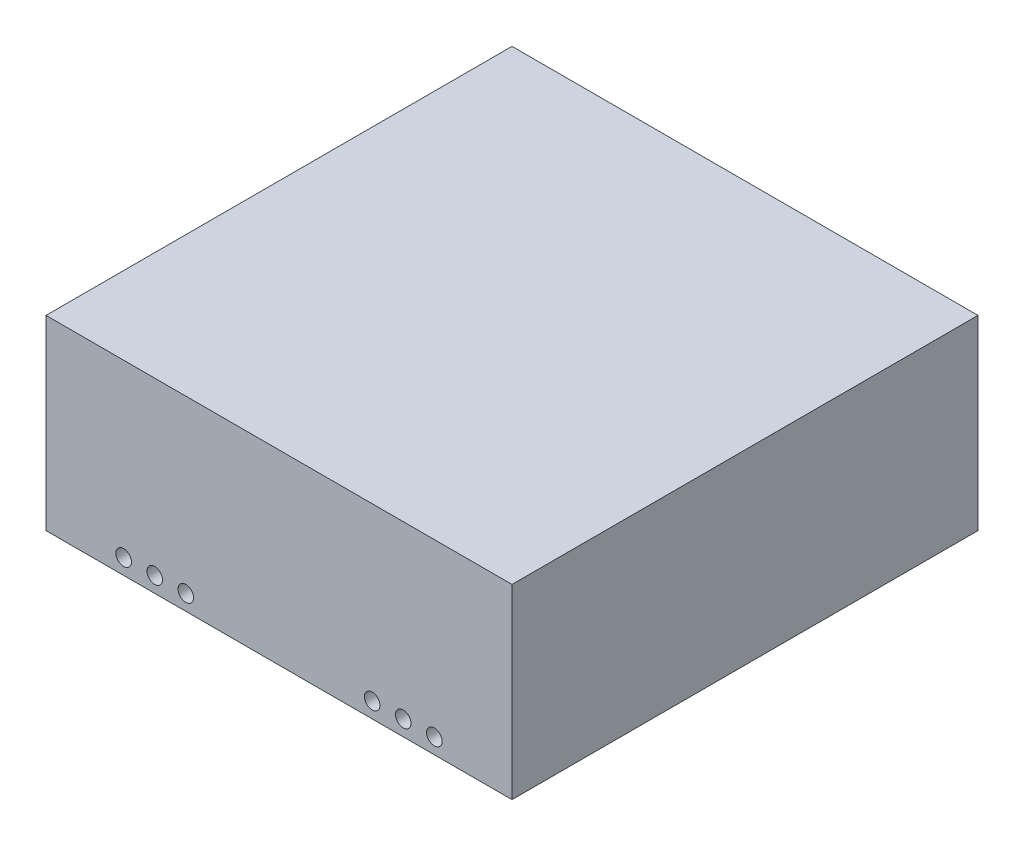
ISO-10303-21;
HEADER;
FILE_DESCRIPTION(('STEP AP214'),'2;1');
FILE_NAME('part.step','',(''),(''),'','','');
FILE_SCHEMA(('AUTOMOTIVE_DESIGN { 1 0 10303 214 1 1 1 1 }'));
ENDSEC;
DATA;
#1=APPLICATION_CONTEXT('core data for automotive mechanical design processes');
#2=APPLICATION_PROTOCOL_DEFINITION('international standard','automotive_design',2000,#1);
#3=PRODUCT_CONTEXT('',#1,'mechanical');
#4=PRODUCT('Part','Part','',(#3));
#5=PRODUCT_RELATED_PRODUCT_CATEGORY('part','',(#4));
#6=PRODUCT_DEFINITION_FORMATION('','',#4);
#7=PRODUCT_DEFINITION_CONTEXT('part definition',#1,'design');
#8=PRODUCT_DEFINITION('design','',#6,#7);
#9=PRODUCT_DEFINITION_SHAPE('','',#8);
#10=(LENGTH_UNIT() NAMED_UNIT(*) SI_UNIT(.MILLI.,.METRE.));
#11=(NAMED_UNIT(*) PLANE_ANGLE_UNIT() SI_UNIT($,.RADIAN.));
#12=(NAMED_UNIT(*) SI_UNIT($,.STERADIAN.) SOLID_ANGLE_UNIT());
#13=UNCERTAINTY_MEASURE_WITH_UNIT(LENGTH_MEASURE(1.E-05),#10,'distance_accuracy_value','');
#14=(GEOMETRIC_REPRESENTATION_CONTEXT(3) GLOBAL_UNCERTAINTY_ASSIGNED_CONTEXT((#13)) GLOBAL_UNIT_ASSIGNED_CONTEXT((#10,
#11,#12)) REPRESENTATION_CONTEXT('',''));
#15=CARTESIAN_POINT('',(0.,0.,0.));
#16=DIRECTION('',(0.,0.,1.));
#17=DIRECTION('',(1.,0.,0.));
#18=AXIS2_PLACEMENT_3D('',#15,#16,#17);
#19=CARTESIAN_POINT('',(75.,60.,-75.));
#20=DIRECTION('',(-1.,0.,0.));
#21=DIRECTION('',(0.,0.,1.));
#22=AXIS2_PLACEMENT_3D('',#19,#20,#21);
#23=PLANE('',#22);
#24=DIRECTION('',(0.,0.,-1.));
#25=VECTOR('',#24,1.);
#26=CARTESIAN_POINT('',(75.,0.,-75.));
#27=LINE('',#26,#25);
#28=CARTESIAN_POINT('',(75.,0.,75.));
#29=VERTEX_POINT('',#28);
#30=CARTESIAN_POINT('',(75.,0.,-75.));
#31=VERTEX_POINT('',#30);
#32=EDGE_CURVE('E135',#29,#31,#27,.T.);
#33=ORIENTED_EDGE('',*,*,#32,.T.);
#34=DIRECTION('',(0.,-1.,0.));
#35=VECTOR('',#34,1.);
#36=CARTESIAN_POINT('',(75.,60.,-75.));
#37=LINE('',#36,#35);
#38=CARTESIAN_POINT('',(75.,60.,-75.));
#39=VERTEX_POINT('',#38);
#40=EDGE_CURVE('E11',#39,#31,#37,.T.);
#41=ORIENTED_EDGE('',*,*,#40,.F.);
#42=DIRECTION('',(0.,0.,-1.));
#43=VECTOR('',#42,1.);
#44=CARTESIAN_POINT('',(75.,60.,-75.));
#45=LINE('',#44,#43);
#46=CARTESIAN_POINT('',(75.,60.,75.));
#47=VERTEX_POINT('',#46);
#48=EDGE_CURVE('E159',#47,#39,#45,.T.);
#49=ORIENTED_EDGE('',*,*,#48,.F.);
#50=DIRECTION('',(0.,-1.,0.));
#51=VECTOR('',#50,1.);
#52=CARTESIAN_POINT('',(75.,60.,75.));
#53=LINE('',#52,#51);
#54=EDGE_CURVE('E164',#47,#29,#53,.T.);
#55=ORIENTED_EDGE('',*,*,#54,.T.);
#56=EDGE_LOOP('',(#33,#41,#49,#55));
#57=FACE_BOUND('',#56,.T.);
#58=ADVANCED_FACE('F37',(#57),#23,.F.);
#59=CARTESIAN_POINT('',(-75.,60.,-75.));
#60=DIRECTION('',(0.,0.,1.));
#61=DIRECTION('',(1.,0.,0.));
#62=AXIS2_PLACEMENT_3D('',#59,#60,#61);
#63=PLANE('',#62);
#64=CARTESIAN_POINT('',(14.5,8.,-75.));
#65=DIRECTION('',(0.,0.,-1.));
#66=DIRECTION('',(-1.,0.,0.));
#67=AXIS2_PLACEMENT_3D('',#64,#65,#66);
#68=CIRCLE('',#67,1.5);
#69=CARTESIAN_POINT('',(13.,8.,-75.));
#70=VERTEX_POINT('',#69);
#71=EDGE_CURVE('E194',#70,#70,#68,.T.);
#72=ORIENTED_EDGE('',*,*,#71,.F.);
#73=EDGE_LOOP('',(#72));
#74=FACE_BOUND('',#73,.T.);
#75=CARTESIAN_POINT('',(-14.5,8.,-75.));
#76=DIRECTION('',(0.,0.,-1.));
#77=DIRECTION('',(-1.,0.,0.));
#78=AXIS2_PLACEMENT_3D('',#75,#76,#77);
#79=CIRCLE('',#78,1.5);
#80=CARTESIAN_POINT('',(-16.,8.,-75.));
#81=VERTEX_POINT('',#80);
#82=EDGE_CURVE('E199',#81,#81,#79,.T.);
#83=ORIENTED_EDGE('',*,*,#82,.F.);
#84=EDGE_LOOP('',(#83));
#85=FACE_BOUND('',#84,.T.);
#86=DIRECTION('',(-1.,0.,0.));
#87=VECTOR('',#86,1.);
#88=CARTESIAN_POINT('',(-75.,0.,-75.));
#89=LINE('',#88,#87);
#90=CARTESIAN_POINT('',(-75.,0.,-75.));
#91=VERTEX_POINT('',#90);
#92=EDGE_CURVE('E139',#31,#91,#89,.T.);
#93=ORIENTED_EDGE('',*,*,#92,.T.);
#94=DIRECTION('',(0.,-1.,0.));
#95=VECTOR('',#94,1.);
#96=CARTESIAN_POINT('',(-75.,60.,-75.));
#97=LINE('',#96,#95);
#98=CARTESIAN_POINT('',(-75.,60.,-75.));
#99=VERTEX_POINT('',#98);
#100=EDGE_CURVE('E45',#99,#91,#97,.T.);
#101=ORIENTED_EDGE('',*,*,#100,.F.);
#102=DIRECTION('',(-1.,0.,0.));
#103=VECTOR('',#102,1.);
#104=CARTESIAN_POINT('',(-75.,60.,-75.));
#105=LINE('',#104,#103);
#106=EDGE_CURVE('E90',#39,#99,#105,.T.);
#107=ORIENTED_EDGE('',*,*,#106,.F.);
#108=ORIENTED_EDGE('',*,*,#40,.T.);
#109=EDGE_LOOP('',(#93,#101,#107,#108));
#110=FACE_BOUND('',#109,.T.);
#111=ADVANCED_FACE('F237',(#74,#85,#110),#63,.F.);
#112=CARTESIAN_POINT('',(-75.,60.,-75.));
#113=DIRECTION('',(1.,0.,0.));
#114=DIRECTION('',(0.,0.,-1.));
#115=AXIS2_PLACEMENT_3D('',#112,#113,#114);
#116=PLANE('',#115);
#117=DIRECTION('',(0.,0.,1.));
#118=VECTOR('',#117,1.);
#119=CARTESIAN_POINT('',(-75.,0.,-75.));
#120=LINE('',#119,#118);
#121=CARTESIAN_POINT('',(-75.,0.,75.));
#122=VERTEX_POINT('',#121);
#123=EDGE_CURVE('E167',#91,#122,#120,.T.);
#124=ORIENTED_EDGE('',*,*,#123,.T.);
#125=DIRECTION('',(0.,-1.,0.));
#126=VECTOR('',#125,1.);
#127=CARTESIAN_POINT('',(-75.,60.,75.));
#128=LINE('',#127,#126);
#129=CARTESIAN_POINT('',(-75.,60.,75.));
#130=VERTEX_POINT('',#129);
#131=EDGE_CURVE('E171',#130,#122,#128,.T.);
#132=ORIENTED_EDGE('',*,*,#131,.F.);
#133=DIRECTION('',(0.,0.,1.));
#134=VECTOR('',#133,1.);
#135=CARTESIAN_POINT('',(-75.,60.,-75.));
#136=LINE('',#135,#134);
#137=EDGE_CURVE('E162',#99,#130,#136,.T.);
#138=ORIENTED_EDGE('',*,*,#137,.F.);
#139=ORIENTED_EDGE('',*,*,#100,.T.);
#140=EDGE_LOOP('',(#124,#132,#138,#139));
#141=FACE_BOUND('',#140,.T.);
#142=ADVANCED_FACE('F228',(#141),#116,.F.);
#143=CARTESIAN_POINT('',(-75.,60.,75.));
#144=DIRECTION('',(0.,0.,-1.));
#145=DIRECTION('',(-1.,0.,0.));
#146=AXIS2_PLACEMENT_3D('',#143,#144,#145);
#147=PLANE('',#146);
#148=CARTESIAN_POINT('',(-50.,5.,75.));
#149=DIRECTION('',(0.,0.,1.));
#150=DIRECTION('',(1.,0.,0.));
#151=AXIS2_PLACEMENT_3D('',#148,#149,#150);
#152=CIRCLE('',#151,2.5);
#153=CARTESIAN_POINT('',(-47.5,5.,75.));
#154=VERTEX_POINT('',#153);
#155=EDGE_CURVE('E179',#154,#154,#152,.T.);
#156=ORIENTED_EDGE('',*,*,#155,.F.);
#157=EDGE_LOOP('',(#156));
#158=FACE_BOUND('',#157,.T.);
#159=CARTESIAN_POINT('',(-40.,5.,75.));
#160=DIRECTION('',(0.,0.,1.));
#161=DIRECTION('',(1.,0.,0.));
#162=AXIS2_PLACEMENT_3D('',#159,#160,#161);
#163=CIRCLE('',#162,2.5);
#164=CARTESIAN_POINT('',(-37.5,5.,75.));
#165=VERTEX_POINT('',#164);
#166=EDGE_CURVE('E208',#165,#165,#163,.T.);
#167=ORIENTED_EDGE('',*,*,#166,.F.);
#168=EDGE_LOOP('',(#167));
#169=FACE_BOUND('',#168,.T.);
#170=CARTESIAN_POINT('',(-30.,5.,75.));
#171=DIRECTION('',(0.,0.,1.));
#172=DIRECTION('',(1.,0.,0.));
#173=AXIS2_PLACEMENT_3D('',#170,#171,#172);
#174=CIRCLE('',#173,2.5);
#175=CARTESIAN_POINT('',(-27.5,5.,75.));
#176=VERTEX_POINT('',#175);
#177=EDGE_CURVE('E211',#176,#176,#174,.T.);
#178=ORIENTED_EDGE('',*,*,#177,.F.);
#179=EDGE_LOOP('',(#178));
#180=FACE_BOUND('',#179,.T.);
#181=CARTESIAN_POINT('',(30.,5.,75.));
#182=DIRECTION('',(0.,0.,1.));
#183=DIRECTION('',(1.,0.,0.));
#184=AXIS2_PLACEMENT_3D('',#181,#182,#183);
#185=CIRCLE('',#184,2.5);
#186=CARTESIAN_POINT('',(32.5,5.,75.));
#187=VERTEX_POINT('',#186);
#188=EDGE_CURVE('E214',#187,#187,#185,.T.);
#189=ORIENTED_EDGE('',*,*,#188,.F.);
#190=EDGE_LOOP('',(#189));
#191=FACE_BOUND('',#190,.T.);
#192=CARTESIAN_POINT('',(40.,5.,75.));
#193=DIRECTION('',(0.,0.,1.));
#194=DIRECTION('',(1.,0.,0.));
#195=AXIS2_PLACEMENT_3D('',#192,#193,#194);
#196=CIRCLE('',#195,2.5);
#197=CARTESIAN_POINT('',(42.5,5.,75.));
#198=VERTEX_POINT('',#197);
#199=EDGE_CURVE('E216',#198,#198,#196,.T.);
#200=ORIENTED_EDGE('',*,*,#199,.F.);
#201=EDGE_LOOP('',(#200));
#202=FACE_BOUND('',#201,.T.);
#203=CARTESIAN_POINT('',(50.,5.,75.));
#204=DIRECTION('',(0.,0.,1.));
#205=DIRECTION('',(1.,0.,0.));
#206=AXIS2_PLACEMENT_3D('',#203,#204,#205);
#207=CIRCLE('',#206,2.5);
#208=CARTESIAN_POINT('',(52.5,5.,75.));
#209=VERTEX_POINT('',#208);
#210=EDGE_CURVE('E144',#209,#209,#207,.T.);
#211=ORIENTED_EDGE('',*,*,#210,.F.);
#212=EDGE_LOOP('',(#211));
#213=FACE_BOUND('',#212,.T.);
#214=DIRECTION('',(1.,0.,0.));
#215=VECTOR('',#214,1.);
#216=CARTESIAN_POINT('',(-75.,0.,75.));
#217=LINE('',#216,#215);
#218=EDGE_CURVE('E83',#122,#29,#217,.T.);
#219=ORIENTED_EDGE('',*,*,#218,.T.);
#220=ORIENTED_EDGE('',*,*,#54,.F.);
#221=DIRECTION('',(1.,0.,0.));
#222=VECTOR('',#221,1.);
#223=CARTESIAN_POINT('',(-75.,60.,75.));
#224=LINE('',#223,#222);
#225=EDGE_CURVE('E62',#130,#47,#224,.T.);
#226=ORIENTED_EDGE('',*,*,#225,.F.);
#227=ORIENTED_EDGE('',*,*,#131,.T.);
#228=EDGE_LOOP('',(#219,#220,#226,#227));
#229=FACE_BOUND('',#228,.T.);
#230=ADVANCED_FACE('F225',(#158,#169,#180,#191,#202,#213,#229),#147,.F.);
#231=CARTESIAN_POINT('',(0.,60.,0.));
#232=DIRECTION('',(0.,1.,0.));
#233=DIRECTION('',(0.,0.,1.));
#234=AXIS2_PLACEMENT_3D('',#231,#232,#233);
#235=PLANE('',#234);
#236=ORIENTED_EDGE('',*,*,#48,.T.);
#237=ORIENTED_EDGE('',*,*,#106,.T.);
#238=ORIENTED_EDGE('',*,*,#137,.T.);
#239=ORIENTED_EDGE('',*,*,#225,.T.);
#240=EDGE_LOOP('',(#236,#237,#238,#239));
#241=FACE_BOUND('',#240,.T.);
#242=ADVANCED_FACE('F227',(#241),#235,.T.);
#243=CARTESIAN_POINT('',(0.,0.,0.));
#244=DIRECTION('',(0.,1.,0.));
#245=DIRECTION('',(0.,0.,1.));
#246=AXIS2_PLACEMENT_3D('',#243,#244,#245);
#247=PLANE('',#246);
#248=DIRECTION('',(1.,0.,0.));
#249=VECTOR('',#248,1.);
#250=CARTESIAN_POINT('',(-75.,0.,67.5));
#251=LINE('',#250,#249);
#252=CARTESIAN_POINT('',(-67.5,0.,67.5));
#253=VERTEX_POINT('',#252);
#254=CARTESIAN_POINT('',(67.5,0.,67.5));
#255=VERTEX_POINT('',#254);
#256=EDGE_CURVE('E130',#253,#255,#251,.T.);
#257=ORIENTED_EDGE('',*,*,#256,.T.);
#258=DIRECTION('',(0.,0.,-1.));
#259=VECTOR('',#258,1.);
#260=CARTESIAN_POINT('',(67.4999999999999,0.,-75.));
#261=LINE('',#260,#259);
#262=CARTESIAN_POINT('',(67.4999999999999,0.,-67.5));
#263=VERTEX_POINT('',#262);
#264=EDGE_CURVE('E152',#255,#263,#261,.T.);
#265=ORIENTED_EDGE('',*,*,#264,.T.);
#266=DIRECTION('',(-1.,0.,0.));
#267=VECTOR('',#266,1.);
#268=CARTESIAN_POINT('',(-75.,0.,-67.5));
#269=LINE('',#268,#267);
#270=CARTESIAN_POINT('',(-67.5,0.,-67.5));
#271=VERTEX_POINT('',#270);
#272=EDGE_CURVE('E134',#263,#271,#269,.T.);
#273=ORIENTED_EDGE('',*,*,#272,.T.);
#274=DIRECTION('',(0.,0.,1.));
#275=VECTOR('',#274,1.);
#276=CARTESIAN_POINT('',(-67.5,0.,-75.));
#277=LINE('',#276,#275);
#278=EDGE_CURVE('E53',#271,#253,#277,.T.);
#279=ORIENTED_EDGE('',*,*,#278,.T.);
#280=EDGE_LOOP('',(#257,#265,#273,#279));
#281=FACE_BOUND('',#280,.T.);
#282=ORIENTED_EDGE('',*,*,#32,.F.);
#283=ORIENTED_EDGE('',*,*,#218,.F.);
#284=ORIENTED_EDGE('',*,*,#123,.F.);
#285=ORIENTED_EDGE('',*,*,#92,.F.);
#286=EDGE_LOOP('',(#282,#283,#284,#285));
#287=FACE_BOUND('',#286,.T.);
#288=ADVANCED_FACE('F235',(#281,#287),#247,.F.);
#289=CARTESIAN_POINT('',(67.4999999999999,60.,-75.));
#290=DIRECTION('',(-1.,0.,0.));
#291=DIRECTION('',(0.,0.,1.));
#292=AXIS2_PLACEMENT_3D('',#289,#290,#291);
#293=PLANE('',#292);
#294=ORIENTED_EDGE('',*,*,#264,.F.);
#295=DIRECTION('',(0.,-1.,0.));
#296=VECTOR('',#295,1.);
#297=CARTESIAN_POINT('',(67.5,60.,67.5));
#298=LINE('',#297,#296);
#299=CARTESIAN_POINT('',(67.5,52.5,67.5));
#300=VERTEX_POINT('',#299);
#301=EDGE_CURVE('E129',#300,#255,#298,.T.);
#302=ORIENTED_EDGE('',*,*,#301,.F.);
#303=DIRECTION('',(0.,0.,-1.));
#304=VECTOR('',#303,1.);
#305=CARTESIAN_POINT('',(67.4999999999999,52.5,-75.));
#306=LINE('',#305,#304);
#307=CARTESIAN_POINT('',(67.4999999999999,52.5,-67.5));
#308=VERTEX_POINT('',#307);
#309=EDGE_CURVE('E117',#300,#308,#306,.T.);
#310=ORIENTED_EDGE('',*,*,#309,.T.);
#311=DIRECTION('',(0.,-1.,0.));
#312=VECTOR('',#311,1.);
#313=CARTESIAN_POINT('',(67.4999999999999,60.,-67.5));
#314=LINE('',#313,#312);
#315=EDGE_CURVE('E127',#308,#263,#314,.T.);
#316=ORIENTED_EDGE('',*,*,#315,.T.);
#317=EDGE_LOOP('',(#294,#302,#310,#316));
#318=FACE_BOUND('',#317,.T.);
#319=ADVANCED_FACE('F126',(#318),#293,.T.);
#320=CARTESIAN_POINT('',(-75.,60.,-67.5));
#321=DIRECTION('',(0.,0.,1.));
#322=DIRECTION('',(1.,0.,0.));
#323=AXIS2_PLACEMENT_3D('',#320,#321,#322);
#324=PLANE('',#323);
#325=CARTESIAN_POINT('',(14.5,8.,-67.5));
#326=DIRECTION('',(0.,0.,1.));
#327=DIRECTION('',(1.,0.,0.));
#328=AXIS2_PLACEMENT_3D('',#325,#326,#327);
#329=CIRCLE('',#328,1.5);
#330=CARTESIAN_POINT('',(16.,8.,-67.5));
#331=VERTEX_POINT('',#330);
#332=EDGE_CURVE('E40',#331,#331,#329,.T.);
#333=ORIENTED_EDGE('',*,*,#332,.F.);
#334=EDGE_LOOP('',(#333));
#335=FACE_BOUND('',#334,.T.);
#336=CARTESIAN_POINT('',(-14.5,8.,-67.5));
#337=DIRECTION('',(0.,0.,1.));
#338=DIRECTION('',(1.,0.,0.));
#339=AXIS2_PLACEMENT_3D('',#336,#337,#338);
#340=CIRCLE('',#339,1.5);
#341=CARTESIAN_POINT('',(-13.,8.,-67.5));
#342=VERTEX_POINT('',#341);
#343=EDGE_CURVE('E192',#342,#342,#340,.T.);
#344=ORIENTED_EDGE('',*,*,#343,.F.);
#345=EDGE_LOOP('',(#344));
#346=FACE_BOUND('',#345,.T.);
#347=ORIENTED_EDGE('',*,*,#272,.F.);
#348=ORIENTED_EDGE('',*,*,#315,.F.);
#349=DIRECTION('',(-1.,0.,0.));
#350=VECTOR('',#349,1.);
#351=CARTESIAN_POINT('',(-75.,52.5,-67.5));
#352=LINE('',#351,#350);
#353=CARTESIAN_POINT('',(-67.5,52.5,-67.5));
#354=VERTEX_POINT('',#353);
#355=EDGE_CURVE('E113',#308,#354,#352,.T.);
#356=ORIENTED_EDGE('',*,*,#355,.T.);
#357=DIRECTION('',(0.,-1.,0.));
#358=VECTOR('',#357,1.);
#359=CARTESIAN_POINT('',(-67.5,60.,-67.5));
#360=LINE('',#359,#358);
#361=EDGE_CURVE('E136',#354,#271,#360,.T.);
#362=ORIENTED_EDGE('',*,*,#361,.T.);
#363=EDGE_LOOP('',(#347,#348,#356,#362));
#364=FACE_BOUND('',#363,.T.);
#365=ADVANCED_FACE('F132',(#335,#346,#364),#324,.T.);
#366=CARTESIAN_POINT('',(-67.5,60.,-75.));
#367=DIRECTION('',(1.,0.,0.));
#368=DIRECTION('',(0.,0.,-1.));
#369=AXIS2_PLACEMENT_3D('',#366,#367,#368);
#370=PLANE('',#369);
#371=ORIENTED_EDGE('',*,*,#278,.F.);
#372=ORIENTED_EDGE('',*,*,#361,.F.);
#373=DIRECTION('',(0.,0.,1.));
#374=VECTOR('',#373,1.);
#375=CARTESIAN_POINT('',(-67.5,52.5,-75.));
#376=LINE('',#375,#374);
#377=CARTESIAN_POINT('',(-67.5,52.5,67.5));
#378=VERTEX_POINT('',#377);
#379=EDGE_CURVE('E118',#354,#378,#376,.T.);
#380=ORIENTED_EDGE('',*,*,#379,.T.);
#381=DIRECTION('',(0.,-1.,0.));
#382=VECTOR('',#381,1.);
#383=CARTESIAN_POINT('',(-67.5,60.,67.5));
#384=LINE('',#383,#382);
#385=EDGE_CURVE('E141',#378,#253,#384,.T.);
#386=ORIENTED_EDGE('',*,*,#385,.T.);
#387=EDGE_LOOP('',(#371,#372,#380,#386));
#388=FACE_BOUND('',#387,.T.);
#389=ADVANCED_FACE('F269',(#388),#370,.T.);
#390=CARTESIAN_POINT('',(-75.,60.,67.5));
#391=DIRECTION('',(0.,0.,-1.));
#392=DIRECTION('',(-1.,0.,0.));
#393=AXIS2_PLACEMENT_3D('',#390,#391,#392);
#394=PLANE('',#393);
#395=CARTESIAN_POINT('',(-50.,5.,67.5));
#396=DIRECTION('',(0.,0.,-1.));
#397=DIRECTION('',(-1.,0.,0.));
#398=AXIS2_PLACEMENT_3D('',#395,#396,#397);
#399=CIRCLE('',#398,2.5);
#400=CARTESIAN_POINT('',(-52.5,5.,67.5));
#401=VERTEX_POINT('',#400);
#402=EDGE_CURVE('E154',#401,#401,#399,.T.);
#403=ORIENTED_EDGE('',*,*,#402,.F.);
#404=EDGE_LOOP('',(#403));
#405=FACE_BOUND('',#404,.T.);
#406=CARTESIAN_POINT('',(-40.,5.,67.5));
#407=DIRECTION('',(0.,0.,-1.));
#408=DIRECTION('',(-1.,0.,0.));
#409=AXIS2_PLACEMENT_3D('',#406,#407,#408);
#410=CIRCLE('',#409,2.5);
#411=CARTESIAN_POINT('',(-42.5,5.,67.5));
#412=VERTEX_POINT('',#411);
#413=EDGE_CURVE('E188',#412,#412,#410,.T.);
#414=ORIENTED_EDGE('',*,*,#413,.F.);
#415=EDGE_LOOP('',(#414));
#416=FACE_BOUND('',#415,.T.);
#417=CARTESIAN_POINT('',(-30.,5.,67.5));
#418=DIRECTION('',(0.,0.,-1.));
#419=DIRECTION('',(-1.,0.,0.));
#420=AXIS2_PLACEMENT_3D('',#417,#418,#419);
#421=CIRCLE('',#420,2.5);
#422=CARTESIAN_POINT('',(-32.5,5.,67.5));
#423=VERTEX_POINT('',#422);
#424=EDGE_CURVE('E185',#423,#423,#421,.T.);
#425=ORIENTED_EDGE('',*,*,#424,.F.);
#426=EDGE_LOOP('',(#425));
#427=FACE_BOUND('',#426,.T.);
#428=CARTESIAN_POINT('',(30.,5.,67.5));
#429=DIRECTION('',(0.,0.,-1.));
#430=DIRECTION('',(-1.,0.,0.));
#431=AXIS2_PLACEMENT_3D('',#428,#429,#430);
#432=CIRCLE('',#431,2.5);
#433=CARTESIAN_POINT('',(27.5,5.,67.5));
#434=VERTEX_POINT('',#433);
#435=EDGE_CURVE('E182',#434,#434,#432,.T.);
#436=ORIENTED_EDGE('',*,*,#435,.F.);
#437=EDGE_LOOP('',(#436));
#438=FACE_BOUND('',#437,.T.);
#439=CARTESIAN_POINT('',(40.,5.,67.5));
#440=DIRECTION('',(0.,0.,-1.));
#441=DIRECTION('',(-1.,0.,0.));
#442=AXIS2_PLACEMENT_3D('',#439,#440,#441);
#443=CIRCLE('',#442,2.5);
#444=CARTESIAN_POINT('',(37.5,5.,67.5));
#445=VERTEX_POINT('',#444);
#446=EDGE_CURVE('E178',#445,#445,#443,.T.);
#447=ORIENTED_EDGE('',*,*,#446,.F.);
#448=EDGE_LOOP('',(#447));
#449=FACE_BOUND('',#448,.T.);
#450=CARTESIAN_POINT('',(50.,5.,67.5));
#451=DIRECTION('',(0.,0.,-1.));
#452=DIRECTION('',(-1.,0.,0.));
#453=AXIS2_PLACEMENT_3D('',#450,#451,#452);
#454=CIRCLE('',#453,2.5);
#455=CARTESIAN_POINT('',(47.5,5.,67.5));
#456=VERTEX_POINT('',#455);
#457=EDGE_CURVE('E175',#456,#456,#454,.T.);
#458=ORIENTED_EDGE('',*,*,#457,.F.);
#459=EDGE_LOOP('',(#458));
#460=FACE_BOUND('',#459,.T.);
#461=ORIENTED_EDGE('',*,*,#256,.F.);
#462=ORIENTED_EDGE('',*,*,#385,.F.);
#463=DIRECTION('',(1.,0.,0.));
#464=VECTOR('',#463,1.);
#465=CARTESIAN_POINT('',(-75.,52.5,67.5));
#466=LINE('',#465,#464);
#467=EDGE_CURVE('E147',#378,#300,#466,.T.);
#468=ORIENTED_EDGE('',*,*,#467,.T.);
#469=ORIENTED_EDGE('',*,*,#301,.T.);
#470=EDGE_LOOP('',(#461,#462,#468,#469));
#471=FACE_BOUND('',#470,.T.);
#472=ADVANCED_FACE('F266',(#405,#416,#427,#438,#449,#460,#471),#394,.T.);
#473=CARTESIAN_POINT('',(0.,52.5,0.));
#474=DIRECTION('',(0.,1.,0.));
#475=DIRECTION('',(0.,0.,1.));
#476=AXIS2_PLACEMENT_3D('',#473,#474,#475);
#477=PLANE('',#476);
#478=ORIENTED_EDGE('',*,*,#309,.F.);
#479=ORIENTED_EDGE('',*,*,#467,.F.);
#480=ORIENTED_EDGE('',*,*,#379,.F.);
#481=ORIENTED_EDGE('',*,*,#355,.F.);
#482=EDGE_LOOP('',(#478,#479,#480,#481));
#483=FACE_BOUND('',#482,.T.);
#484=ADVANCED_FACE('F115',(#483),#477,.F.);
#485=CARTESIAN_POINT('',(50.,5.,65.));
#486=DIRECTION('',(0.,0.,1.));
#487=DIRECTION('',(1.,0.,0.));
#488=AXIS2_PLACEMENT_3D('',#485,#486,#487);
#489=CYLINDRICAL_SURFACE('',#488,2.5);
#490=ORIENTED_EDGE('',*,*,#457,.T.);
#491=EDGE_LOOP('',(#490));
#492=FACE_BOUND('',#491,.T.);
#493=ORIENTED_EDGE('',*,*,#210,.T.);
#494=EDGE_LOOP('',(#493));
#495=FACE_BOUND('',#494,.T.);
#496=ADVANCED_FACE('F223',(#492,#495),#489,.F.);
#497=CARTESIAN_POINT('',(40.,5.,65.));
#498=DIRECTION('',(0.,0.,1.));
#499=DIRECTION('',(1.,0.,0.));
#500=AXIS2_PLACEMENT_3D('',#497,#498,#499);
#501=CYLINDRICAL_SURFACE('',#500,2.5);
#502=ORIENTED_EDGE('',*,*,#446,.T.);
#503=EDGE_LOOP('',(#502));
#504=FACE_BOUND('',#503,.T.);
#505=ORIENTED_EDGE('',*,*,#199,.T.);
#506=EDGE_LOOP('',(#505));
#507=FACE_BOUND('',#506,.T.);
#508=ADVANCED_FACE('F278',(#504,#507),#501,.F.);
#509=CARTESIAN_POINT('',(30.,5.,65.));
#510=DIRECTION('',(0.,0.,1.));
#511=DIRECTION('',(1.,0.,0.));
#512=AXIS2_PLACEMENT_3D('',#509,#510,#511);
#513=CYLINDRICAL_SURFACE('',#512,2.5);
#514=ORIENTED_EDGE('',*,*,#435,.T.);
#515=EDGE_LOOP('',(#514));
#516=FACE_BOUND('',#515,.T.);
#517=ORIENTED_EDGE('',*,*,#188,.T.);
#518=EDGE_LOOP('',(#517));
#519=FACE_BOUND('',#518,.T.);
#520=ADVANCED_FACE('F282',(#516,#519),#513,.F.);
#521=CARTESIAN_POINT('',(-30.,5.,65.));
#522=DIRECTION('',(0.,0.,1.));
#523=DIRECTION('',(1.,0.,0.));
#524=AXIS2_PLACEMENT_3D('',#521,#522,#523);
#525=CYLINDRICAL_SURFACE('',#524,2.5);
#526=ORIENTED_EDGE('',*,*,#424,.T.);
#527=EDGE_LOOP('',(#526));
#528=FACE_BOUND('',#527,.T.);
#529=ORIENTED_EDGE('',*,*,#177,.T.);
#530=EDGE_LOOP('',(#529));
#531=FACE_BOUND('',#530,.T.);
#532=ADVANCED_FACE('F286',(#528,#531),#525,.F.);
#533=CARTESIAN_POINT('',(-40.,5.,65.));
#534=DIRECTION('',(0.,0.,1.));
#535=DIRECTION('',(1.,0.,0.));
#536=AXIS2_PLACEMENT_3D('',#533,#534,#535);
#537=CYLINDRICAL_SURFACE('',#536,2.5);
#538=ORIENTED_EDGE('',*,*,#413,.T.);
#539=EDGE_LOOP('',(#538));
#540=FACE_BOUND('',#539,.T.);
#541=ORIENTED_EDGE('',*,*,#166,.T.);
#542=EDGE_LOOP('',(#541));
#543=FACE_BOUND('',#542,.T.);
#544=ADVANCED_FACE('F290',(#540,#543),#537,.F.);
#545=CARTESIAN_POINT('',(-50.,5.,65.));
#546=DIRECTION('',(0.,0.,1.));
#547=DIRECTION('',(1.,0.,0.));
#548=AXIS2_PLACEMENT_3D('',#545,#546,#547);
#549=CYLINDRICAL_SURFACE('',#548,2.5);
#550=ORIENTED_EDGE('',*,*,#402,.T.);
#551=EDGE_LOOP('',(#550));
#552=FACE_BOUND('',#551,.T.);
#553=ORIENTED_EDGE('',*,*,#155,.T.);
#554=EDGE_LOOP('',(#553));
#555=FACE_BOUND('',#554,.T.);
#556=ADVANCED_FACE('F294',(#552,#555),#549,.F.);
#557=CARTESIAN_POINT('',(-14.5,8.,-65.));
#558=DIRECTION('',(0.,0.,-1.));
#559=DIRECTION('',(-1.,0.,0.));
#560=AXIS2_PLACEMENT_3D('',#557,#558,#559);
#561=CYLINDRICAL_SURFACE('',#560,1.5);
#562=ORIENTED_EDGE('',*,*,#343,.T.);
#563=EDGE_LOOP('',(#562));
#564=FACE_BOUND('',#563,.T.);
#565=ORIENTED_EDGE('',*,*,#82,.T.);
#566=EDGE_LOOP('',(#565));
#567=FACE_BOUND('',#566,.T.);
#568=ADVANCED_FACE('F298',(#564,#567),#561,.F.);
#569=CARTESIAN_POINT('',(14.5,8.,-65.));
#570=DIRECTION('',(0.,0.,-1.));
#571=DIRECTION('',(-1.,0.,0.));
#572=AXIS2_PLACEMENT_3D('',#569,#570,#571);
#573=CYLINDRICAL_SURFACE('',#572,1.5);
#574=ORIENTED_EDGE('',*,*,#332,.T.);
#575=EDGE_LOOP('',(#574));
#576=FACE_BOUND('',#575,.T.);
#577=ORIENTED_EDGE('',*,*,#71,.T.);
#578=EDGE_LOOP('',(#577));
#579=FACE_BOUND('',#578,.T.);
#580=ADVANCED_FACE('F302',(#576,#579),#573,.F.);
#581=CLOSED_SHELL('',(#58,#111,#142,#230,#242,#288,#319,#365,#389,#472,#484,#496,#508,#520,#532,
#544,#556,#568,#580));
#582=MANIFOLD_SOLID_BREP('B2',#581);
#583=ADVANCED_BREP_SHAPE_REPRESENTATION('',(#18,#582),#14);
#584=SHAPE_DEFINITION_REPRESENTATION(#9,#583);
ENDSEC;
END-ISO-10303-21;
